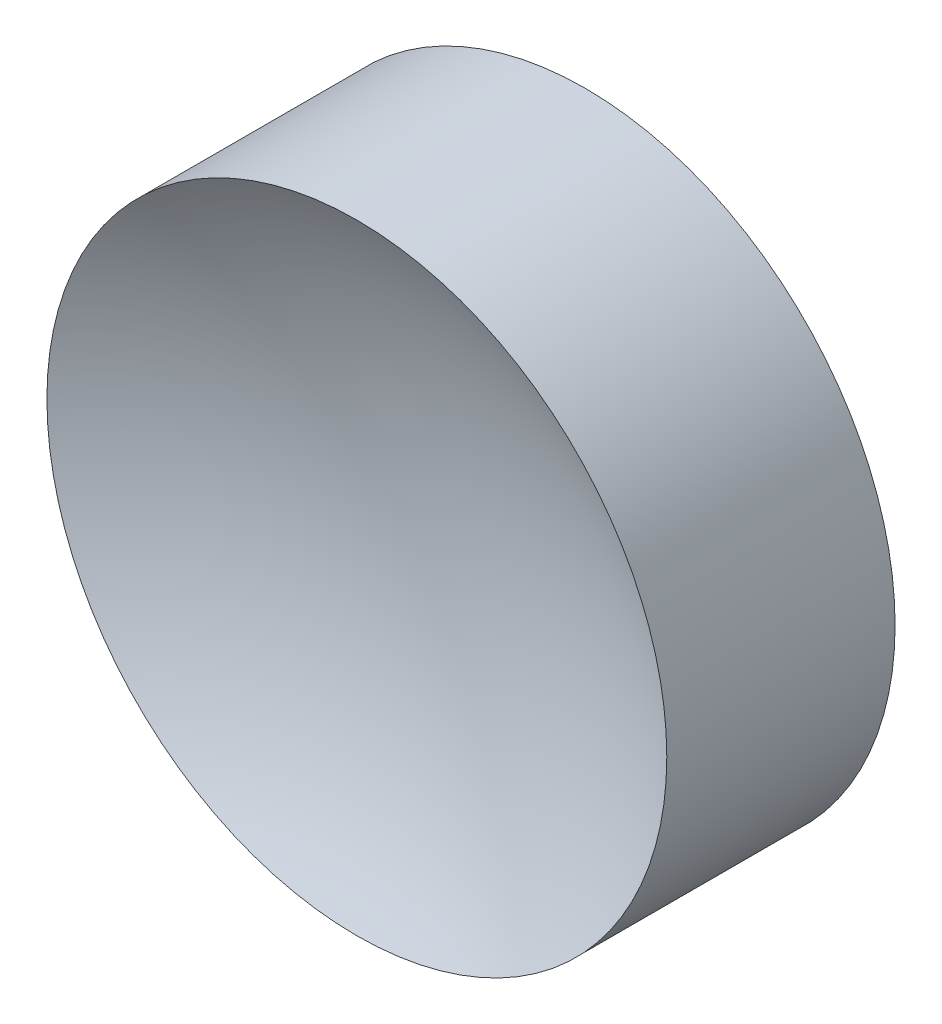
ISO-10303-21;
HEADER;
FILE_DESCRIPTION(('STEP AP214'),'2;1');
FILE_NAME('part.step','',(''),(''),'','','');
FILE_SCHEMA(('AUTOMOTIVE_DESIGN { 1 0 10303 214 1 1 1 1 }'));
ENDSEC;
DATA;
#1=APPLICATION_CONTEXT('core data for automotive mechanical design processes');
#2=APPLICATION_PROTOCOL_DEFINITION('international standard','automotive_design',2000,#1);
#3=PRODUCT_CONTEXT('',#1,'mechanical');
#4=PRODUCT('Part','Part','',(#3));
#5=PRODUCT_RELATED_PRODUCT_CATEGORY('part','',(#4));
#6=PRODUCT_DEFINITION_FORMATION('','',#4);
#7=PRODUCT_DEFINITION_CONTEXT('part definition',#1,'design');
#8=PRODUCT_DEFINITION('design','',#6,#7);
#9=PRODUCT_DEFINITION_SHAPE('','',#8);
#10=(LENGTH_UNIT() NAMED_UNIT(*) SI_UNIT(.MILLI.,.METRE.));
#11=(NAMED_UNIT(*) PLANE_ANGLE_UNIT() SI_UNIT($,.RADIAN.));
#12=(NAMED_UNIT(*) SI_UNIT($,.STERADIAN.) SOLID_ANGLE_UNIT());
#13=UNCERTAINTY_MEASURE_WITH_UNIT(LENGTH_MEASURE(1.E-05),#10,'distance_accuracy_value','');
#14=(GEOMETRIC_REPRESENTATION_CONTEXT(3) GLOBAL_UNCERTAINTY_ASSIGNED_CONTEXT((#13)) GLOBAL_UNIT_ASSIGNED_CONTEXT((#10,
#11,#12)) REPRESENTATION_CONTEXT('',''));
#15=CARTESIAN_POINT('',(0.,0.,0.));
#16=DIRECTION('',(0.,0.,1.));
#17=DIRECTION('',(1.,0.,0.));
#18=AXIS2_PLACEMENT_3D('',#15,#16,#17);
#19=CARTESIAN_POINT('',(0.,0.,13.5214465927879));
#20=DIRECTION('',(0.,0.,1.));
#21=DIRECTION('',(0.,1.,0.));
#22=AXIS2_PLACEMENT_3D('',#19,#20,#21);
#23=SPHERICAL_SURFACE('',#22,12.86);
#24=CARTESIAN_POINT('',(0.,0.,2.33855340721205));
#25=DIRECTION('',(0.,0.,1.));
#26=DIRECTION('',(1.,0.,0.));
#27=AXIS2_PLACEMENT_3D('',#24,#25,#26);
#28=CIRCLE('',#27,6.35);
#29=CARTESIAN_POINT('',(6.35,0.,2.33855340721205));
#30=VERTEX_POINT('',#29);
#31=EDGE_CURVE('E18',#30,#30,#28,.T.);
#32=ORIENTED_EDGE('',*,*,#31,.T.);
#33=EDGE_LOOP('',(#32));
#34=FACE_BOUND('',#33,.T.);
#35=ADVANCED_FACE('F12',(#34),#23,.F.);
#36=CARTESIAN_POINT('',(0.,0.,-2.33855340721205));
#37=DIRECTION('',(0.,0.,1.));
#38=DIRECTION('',(1.,0.,0.));
#39=AXIS2_PLACEMENT_3D('',#36,#37,#38);
#40=PLANE('',#39);
#41=CARTESIAN_POINT('',(0.,0.,-2.33855340721205));
#42=DIRECTION('',(0.,0.,1.));
#43=DIRECTION('',(1.,0.,0.));
#44=AXIS2_PLACEMENT_3D('',#41,#42,#43);
#45=CIRCLE('',#44,6.35);
#46=CARTESIAN_POINT('',(6.35,0.,-2.33855340721205));
#47=VERTEX_POINT('',#46);
#48=EDGE_CURVE('E8',#47,#47,#45,.T.);
#49=ORIENTED_EDGE('',*,*,#48,.F.);
#50=EDGE_LOOP('',(#49));
#51=FACE_BOUND('',#50,.T.);
#52=ADVANCED_FACE('F27',(#51),#40,.F.);
#53=CARTESIAN_POINT('',(0.,0.,8.17859986321728));
#54=DIRECTION('',(0.,0.,1.));
#55=DIRECTION('',(1.,0.,0.));
#56=AXIS2_PLACEMENT_3D('',#53,#54,#55);
#57=CYLINDRICAL_SURFACE('',#56,6.35);
#58=ORIENTED_EDGE('',*,*,#31,.F.);
#59=EDGE_LOOP('',(#58));
#60=FACE_BOUND('',#59,.T.);
#61=ORIENTED_EDGE('',*,*,#48,.T.);
#62=EDGE_LOOP('',(#61));
#63=FACE_BOUND('',#62,.T.);
#64=ADVANCED_FACE('F25',(#60,#63),#57,.T.);
#65=CLOSED_SHELL('',(#35,#52,#64));
#66=MANIFOLD_SOLID_BREP('B1',#65);
#67=ADVANCED_BREP_SHAPE_REPRESENTATION('',(#18,#66),#14);
#68=SHAPE_DEFINITION_REPRESENTATION(#9,#67);
ENDSEC;
END-ISO-10303-21;
